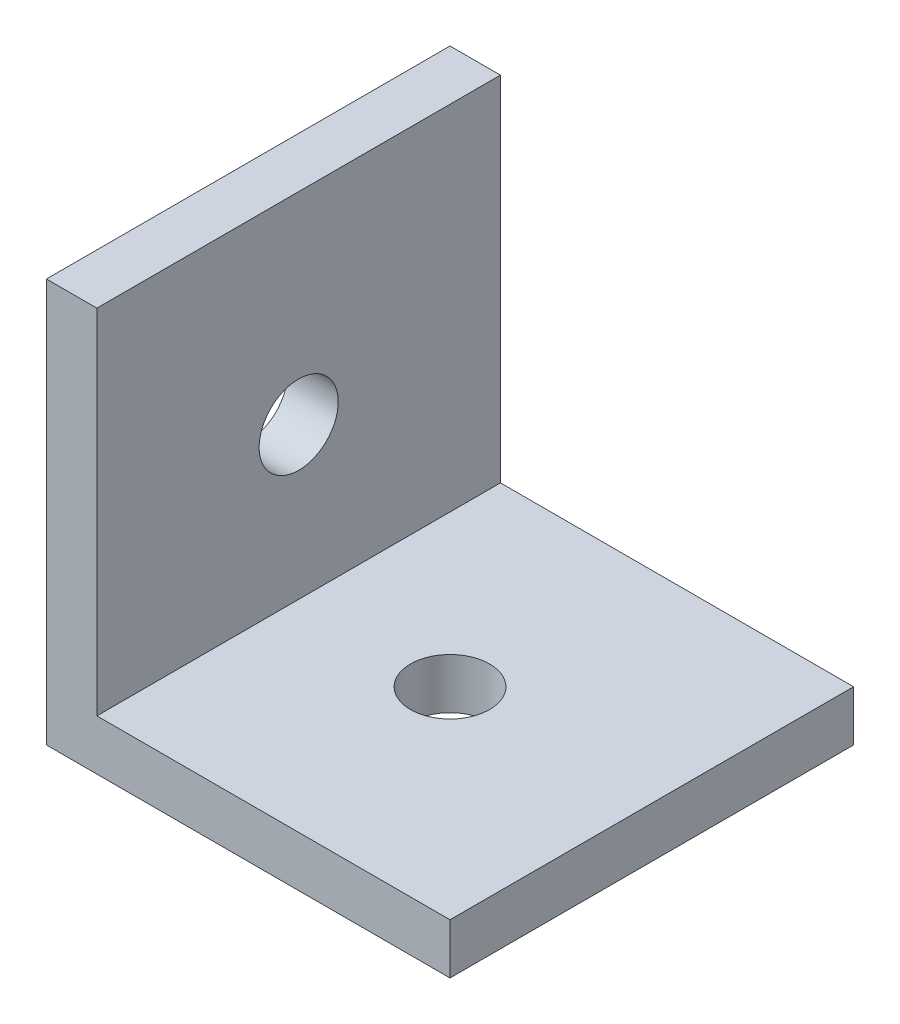
ISO-10303-21;
HEADER;
FILE_DESCRIPTION(('STEP AP214'),'2;1');
FILE_NAME('part.step','',(''),(''),'','','');
FILE_SCHEMA(('AUTOMOTIVE_DESIGN { 1 0 10303 214 1 1 1 1 }'));
ENDSEC;
DATA;
#1=APPLICATION_CONTEXT('core data for automotive mechanical design processes');
#2=APPLICATION_PROTOCOL_DEFINITION('international standard','automotive_design',2000,#1);
#3=PRODUCT_CONTEXT('',#1,'mechanical');
#4=PRODUCT('Part','Part','',(#3));
#5=PRODUCT_RELATED_PRODUCT_CATEGORY('part','',(#4));
#6=PRODUCT_DEFINITION_FORMATION('','',#4);
#7=PRODUCT_DEFINITION_CONTEXT('part definition',#1,'design');
#8=PRODUCT_DEFINITION('design','',#6,#7);
#9=PRODUCT_DEFINITION_SHAPE('','',#8);
#10=(LENGTH_UNIT() NAMED_UNIT(*) SI_UNIT(.MILLI.,.METRE.));
#11=(NAMED_UNIT(*) PLANE_ANGLE_UNIT() SI_UNIT($,.RADIAN.));
#12=(NAMED_UNIT(*) SI_UNIT($,.STERADIAN.) SOLID_ANGLE_UNIT());
#13=UNCERTAINTY_MEASURE_WITH_UNIT(LENGTH_MEASURE(1.E-05),#10,'distance_accuracy_value','');
#14=(GEOMETRIC_REPRESENTATION_CONTEXT(3) GLOBAL_UNCERTAINTY_ASSIGNED_CONTEXT((#13)) GLOBAL_UNIT_ASSIGNED_CONTEXT((#10,
#11,#12)) REPRESENTATION_CONTEXT('',''));
#15=CARTESIAN_POINT('',(0.,0.,0.));
#16=DIRECTION('',(0.,0.,1.));
#17=DIRECTION('',(1.,0.,0.));
#18=AXIS2_PLACEMENT_3D('',#15,#16,#17);
#19=CARTESIAN_POINT('',(0.,0.,-25.4));
#20=DIRECTION('',(0.,-1.,0.));
#21=DIRECTION('',(0.,0.,-1.));
#22=AXIS2_PLACEMENT_3D('',#19,#20,#21);
#23=PLANE('',#22);
#24=CARTESIAN_POINT('',(12.7,0.,-12.7));
#25=DIRECTION('',(0.,-1.,0.));
#26=DIRECTION('',(0.,0.,-1.));
#27=AXIS2_PLACEMENT_3D('',#24,#25,#26);
#28=CIRCLE('',#27,2.4892);
#29=CARTESIAN_POINT('',(12.7,0.,-15.1892));
#30=VERTEX_POINT('',#29);
#31=EDGE_CURVE('E139',#30,#30,#28,.T.);
#32=ORIENTED_EDGE('',*,*,#31,.F.);
#33=EDGE_LOOP('',(#32));
#34=FACE_BOUND('',#33,.T.);
#35=DIRECTION('',(1.,0.,0.));
#36=VECTOR('',#35,1.);
#37=CARTESIAN_POINT('',(0.,0.,0.));
#38=LINE('',#37,#36);
#39=CARTESIAN_POINT('',(0.,0.,0.));
#40=VERTEX_POINT('',#39);
#41=CARTESIAN_POINT('',(25.4,0.,0.));
#42=VERTEX_POINT('',#41);
#43=EDGE_CURVE('E117',#40,#42,#38,.T.);
#44=ORIENTED_EDGE('',*,*,#43,.F.);
#45=DIRECTION('',(0.,0.,1.));
#46=VECTOR('',#45,1.);
#47=CARTESIAN_POINT('',(0.,0.,-25.4));
#48=LINE('',#47,#46);
#49=CARTESIAN_POINT('',(0.,0.,-25.4));
#50=VERTEX_POINT('',#49);
#51=EDGE_CURVE('E11',#50,#40,#48,.T.);
#52=ORIENTED_EDGE('',*,*,#51,.F.);
#53=DIRECTION('',(1.,0.,0.));
#54=VECTOR('',#53,1.);
#55=CARTESIAN_POINT('',(0.,0.,-25.4));
#56=LINE('',#55,#54);
#57=CARTESIAN_POINT('',(25.4,0.,-25.4));
#58=VERTEX_POINT('',#57);
#59=EDGE_CURVE('E131',#50,#58,#56,.T.);
#60=ORIENTED_EDGE('',*,*,#59,.T.);
#61=DIRECTION('',(0.,0.,1.));
#62=VECTOR('',#61,1.);
#63=CARTESIAN_POINT('',(25.4,0.,-25.4));
#64=LINE('',#63,#62);
#65=EDGE_CURVE('E116',#58,#42,#64,.T.);
#66=ORIENTED_EDGE('',*,*,#65,.T.);
#67=EDGE_LOOP('',(#44,#52,#60,#66));
#68=FACE_BOUND('',#67,.T.);
#69=ADVANCED_FACE('F34',(#34,#68),#23,.T.);
#70=CARTESIAN_POINT('',(0.,0.,-25.4));
#71=DIRECTION('',(-1.,0.,0.));
#72=DIRECTION('',(0.,-1.,0.));
#73=AXIS2_PLACEMENT_3D('',#70,#71,#72);
#74=PLANE('',#73);
#75=CARTESIAN_POINT('',(0.,12.7,-12.7));
#76=DIRECTION('',(1.,0.,0.));
#77=DIRECTION('',(0.,0.,-1.));
#78=AXIS2_PLACEMENT_3D('',#75,#76,#77);
#79=CIRCLE('',#78,2.4892);
#80=CARTESIAN_POINT('',(0.,12.7,-15.1892));
#81=VERTEX_POINT('',#80);
#82=EDGE_CURVE('E147',#81,#81,#79,.T.);
#83=ORIENTED_EDGE('',*,*,#82,.T.);
#84=EDGE_LOOP('',(#83));
#85=FACE_BOUND('',#84,.T.);
#86=DIRECTION('',(0.,-1.,0.));
#87=VECTOR('',#86,1.);
#88=CARTESIAN_POINT('',(0.,0.,0.));
#89=LINE('',#88,#87);
#90=CARTESIAN_POINT('',(0.,25.4,0.));
#91=VERTEX_POINT('',#90);
#92=EDGE_CURVE('E129',#91,#40,#89,.T.);
#93=ORIENTED_EDGE('',*,*,#92,.F.);
#94=DIRECTION('',(0.,0.,1.));
#95=VECTOR('',#94,1.);
#96=CARTESIAN_POINT('',(0.,25.4,-25.4));
#97=LINE('',#96,#95);
#98=CARTESIAN_POINT('',(0.,25.4,-25.4));
#99=VERTEX_POINT('',#98);
#100=EDGE_CURVE('E43',#99,#91,#97,.T.);
#101=ORIENTED_EDGE('',*,*,#100,.F.);
#102=DIRECTION('',(0.,-1.,0.));
#103=VECTOR('',#102,1.);
#104=CARTESIAN_POINT('',(0.,0.,-25.4));
#105=LINE('',#104,#103);
#106=EDGE_CURVE('E97',#99,#50,#105,.T.);
#107=ORIENTED_EDGE('',*,*,#106,.T.);
#108=ORIENTED_EDGE('',*,*,#51,.T.);
#109=EDGE_LOOP('',(#93,#101,#107,#108));
#110=FACE_BOUND('',#109,.T.);
#111=ADVANCED_FACE('F150',(#85,#110),#74,.T.);
#112=CARTESIAN_POINT('',(0.,25.4,-25.4));
#113=DIRECTION('',(0.,-1.,0.));
#114=DIRECTION('',(0.,0.,-1.));
#115=AXIS2_PLACEMENT_3D('',#112,#113,#114);
#116=PLANE('',#115);
#117=DIRECTION('',(1.,0.,0.));
#118=VECTOR('',#117,1.);
#119=CARTESIAN_POINT('',(0.,25.4,0.));
#120=LINE('',#119,#118);
#121=CARTESIAN_POINT('',(3.175,25.4,0.));
#122=VERTEX_POINT('',#121);
#123=EDGE_CURVE('E102',#91,#122,#120,.T.);
#124=ORIENTED_EDGE('',*,*,#123,.T.);
#125=DIRECTION('',(0.,0.,1.));
#126=VECTOR('',#125,1.);
#127=CARTESIAN_POINT('',(3.175,25.4,-25.4));
#128=LINE('',#127,#126);
#129=CARTESIAN_POINT('',(3.175,25.4,-25.4));
#130=VERTEX_POINT('',#129);
#131=EDGE_CURVE('E100',#130,#122,#128,.T.);
#132=ORIENTED_EDGE('',*,*,#131,.F.);
#133=DIRECTION('',(1.,0.,0.));
#134=VECTOR('',#133,1.);
#135=CARTESIAN_POINT('',(0.,25.4,-25.4));
#136=LINE('',#135,#134);
#137=EDGE_CURVE('E91',#99,#130,#136,.T.);
#138=ORIENTED_EDGE('',*,*,#137,.F.);
#139=ORIENTED_EDGE('',*,*,#100,.T.);
#140=EDGE_LOOP('',(#124,#132,#138,#139));
#141=FACE_BOUND('',#140,.T.);
#142=ADVANCED_FACE('F101',(#141),#116,.F.);
#143=CARTESIAN_POINT('',(3.175,0.,-25.4));
#144=DIRECTION('',(-1.,0.,0.));
#145=DIRECTION('',(0.,-1.,0.));
#146=AXIS2_PLACEMENT_3D('',#143,#144,#145);
#147=PLANE('',#146);
#148=CARTESIAN_POINT('',(3.175,12.7,-12.7));
#149=DIRECTION('',(-1.,0.,0.));
#150=DIRECTION('',(0.,-1.,0.));
#151=AXIS2_PLACEMENT_3D('',#148,#149,#150);
#152=CIRCLE('',#151,2.4892);
#153=CARTESIAN_POINT('',(3.175,10.2108,-12.7));
#154=VERTEX_POINT('',#153);
#155=EDGE_CURVE('E37',#154,#154,#152,.F.);
#156=ORIENTED_EDGE('',*,*,#155,.F.);
#157=EDGE_LOOP('',(#156));
#158=FACE_BOUND('',#157,.T.);
#159=DIRECTION('',(0.,-1.,0.));
#160=VECTOR('',#159,1.);
#161=CARTESIAN_POINT('',(3.175,0.,0.));
#162=LINE('',#161,#160);
#163=CARTESIAN_POINT('',(3.175,3.175,0.));
#164=VERTEX_POINT('',#163);
#165=EDGE_CURVE('E126',#122,#164,#162,.T.);
#166=ORIENTED_EDGE('',*,*,#165,.T.);
#167=DIRECTION('',(0.,0.,1.));
#168=VECTOR('',#167,1.);
#169=CARTESIAN_POINT('',(3.175,3.175,-25.4));
#170=LINE('',#169,#168);
#171=CARTESIAN_POINT('',(3.175,3.175,-25.4));
#172=VERTEX_POINT('',#171);
#173=EDGE_CURVE('E105',#172,#164,#170,.T.);
#174=ORIENTED_EDGE('',*,*,#173,.F.);
#175=DIRECTION('',(0.,-1.,0.));
#176=VECTOR('',#175,1.);
#177=CARTESIAN_POINT('',(3.175,0.,-25.4));
#178=LINE('',#177,#176);
#179=EDGE_CURVE('E95',#130,#172,#178,.T.);
#180=ORIENTED_EDGE('',*,*,#179,.F.);
#181=ORIENTED_EDGE('',*,*,#131,.T.);
#182=EDGE_LOOP('',(#166,#174,#180,#181));
#183=FACE_BOUND('',#182,.T.);
#184=ADVANCED_FACE('F107',(#158,#183),#147,.F.);
#185=CARTESIAN_POINT('',(0.,3.175,-25.4));
#186=DIRECTION('',(0.,-1.,0.));
#187=DIRECTION('',(0.,0.,-1.));
#188=AXIS2_PLACEMENT_3D('',#185,#186,#187);
#189=PLANE('',#188);
#190=CARTESIAN_POINT('',(12.7,3.175,-12.7));
#191=DIRECTION('',(0.,-1.,0.));
#192=DIRECTION('',(0.,0.,-1.));
#193=AXIS2_PLACEMENT_3D('',#190,#191,#192);
#194=CIRCLE('',#193,2.4892);
#195=CARTESIAN_POINT('',(12.7,3.175,-15.1892));
#196=VERTEX_POINT('',#195);
#197=EDGE_CURVE('E121',#196,#196,#194,.T.);
#198=ORIENTED_EDGE('',*,*,#197,.T.);
#199=EDGE_LOOP('',(#198));
#200=FACE_BOUND('',#199,.T.);
#201=DIRECTION('',(1.,0.,0.));
#202=VECTOR('',#201,1.);
#203=CARTESIAN_POINT('',(0.,3.175,0.));
#204=LINE('',#203,#202);
#205=CARTESIAN_POINT('',(25.4,3.175,0.));
#206=VERTEX_POINT('',#205);
#207=EDGE_CURVE('E124',#164,#206,#204,.T.);
#208=ORIENTED_EDGE('',*,*,#207,.T.);
#209=DIRECTION('',(0.,0.,1.));
#210=VECTOR('',#209,1.);
#211=CARTESIAN_POINT('',(25.4,3.175,-25.4));
#212=LINE('',#211,#210);
#213=CARTESIAN_POINT('',(25.4,3.175,-25.4));
#214=VERTEX_POINT('',#213);
#215=EDGE_CURVE('E135',#214,#206,#212,.T.);
#216=ORIENTED_EDGE('',*,*,#215,.F.);
#217=DIRECTION('',(1.,0.,0.));
#218=VECTOR('',#217,1.);
#219=CARTESIAN_POINT('',(0.,3.175,-25.4));
#220=LINE('',#219,#218);
#221=EDGE_CURVE('E110',#172,#214,#220,.T.);
#222=ORIENTED_EDGE('',*,*,#221,.F.);
#223=ORIENTED_EDGE('',*,*,#173,.T.);
#224=EDGE_LOOP('',(#208,#216,#222,#223));
#225=FACE_BOUND('',#224,.T.);
#226=ADVANCED_FACE('F156',(#200,#225),#189,.F.);
#227=CARTESIAN_POINT('',(25.4,3.175,-25.4));
#228=DIRECTION('',(-1.,0.,0.));
#229=DIRECTION('',(0.,0.,1.));
#230=AXIS2_PLACEMENT_3D('',#227,#228,#229);
#231=PLANE('',#230);
#232=DIRECTION('',(0.,-1.,0.));
#233=VECTOR('',#232,1.);
#234=CARTESIAN_POINT('',(25.4,3.175,0.));
#235=LINE('',#234,#233);
#236=EDGE_CURVE('E120',#206,#42,#235,.T.);
#237=ORIENTED_EDGE('',*,*,#236,.T.);
#238=ORIENTED_EDGE('',*,*,#65,.F.);
#239=DIRECTION('',(0.,-1.,0.));
#240=VECTOR('',#239,1.);
#241=CARTESIAN_POINT('',(25.4,3.175,-25.4));
#242=LINE('',#241,#240);
#243=EDGE_CURVE('E83',#214,#58,#242,.T.);
#244=ORIENTED_EDGE('',*,*,#243,.F.);
#245=ORIENTED_EDGE('',*,*,#215,.T.);
#246=EDGE_LOOP('',(#237,#238,#244,#245));
#247=FACE_BOUND('',#246,.T.);
#248=ADVANCED_FACE('F159',(#247),#231,.F.);
#249=CARTESIAN_POINT('',(0.,0.,-25.4));
#250=DIRECTION('',(0.,0.,-1.));
#251=DIRECTION('',(-1.,0.,0.));
#252=AXIS2_PLACEMENT_3D('',#249,#250,#251);
#253=PLANE('',#252);
#254=ORIENTED_EDGE('',*,*,#59,.F.);
#255=ORIENTED_EDGE('',*,*,#106,.F.);
#256=ORIENTED_EDGE('',*,*,#137,.T.);
#257=ORIENTED_EDGE('',*,*,#179,.T.);
#258=ORIENTED_EDGE('',*,*,#221,.T.);
#259=ORIENTED_EDGE('',*,*,#243,.T.);
#260=EDGE_LOOP('',(#254,#255,#256,#257,#258,#259));
#261=FACE_BOUND('',#260,.T.);
#262=ADVANCED_FACE('F93',(#261),#253,.T.);
#263=CARTESIAN_POINT('',(0.,0.,0.));
#264=DIRECTION('',(0.,0.,-1.));
#265=DIRECTION('',(-1.,0.,0.));
#266=AXIS2_PLACEMENT_3D('',#263,#264,#265);
#267=PLANE('',#266);
#268=ORIENTED_EDGE('',*,*,#43,.T.);
#269=ORIENTED_EDGE('',*,*,#236,.F.);
#270=ORIENTED_EDGE('',*,*,#207,.F.);
#271=ORIENTED_EDGE('',*,*,#165,.F.);
#272=ORIENTED_EDGE('',*,*,#123,.F.);
#273=ORIENTED_EDGE('',*,*,#92,.T.);
#274=EDGE_LOOP('',(#268,#269,#270,#271,#272,#273));
#275=FACE_BOUND('',#274,.T.);
#276=ADVANCED_FACE('F152',(#275),#267,.F.);
#277=CARTESIAN_POINT('',(12.7,25.4,-12.7));
#278=DIRECTION('',(0.,-1.,0.));
#279=DIRECTION('',(0.,0.,-1.));
#280=AXIS2_PLACEMENT_3D('',#277,#278,#279);
#281=CYLINDRICAL_SURFACE('',#280,2.4892);
#282=ORIENTED_EDGE('',*,*,#31,.T.);
#283=EDGE_LOOP('',(#282));
#284=FACE_BOUND('',#283,.T.);
#285=ORIENTED_EDGE('',*,*,#197,.F.);
#286=EDGE_LOOP('',(#285));
#287=FACE_BOUND('',#286,.T.);
#288=ADVANCED_FACE('F189',(#284,#287),#281,.F.);
#289=CARTESIAN_POINT('',(25.4,12.7,-12.7));
#290=DIRECTION('',(-1.,0.,0.));
#291=DIRECTION('',(0.,-1.,0.));
#292=AXIS2_PLACEMENT_3D('',#289,#290,#291);
#293=CYLINDRICAL_SURFACE('',#292,2.4892);
#294=ORIENTED_EDGE('',*,*,#82,.F.);
#295=EDGE_LOOP('',(#294));
#296=FACE_BOUND('',#295,.T.);
#297=ORIENTED_EDGE('',*,*,#155,.T.);
#298=EDGE_LOOP('',(#297));
#299=FACE_BOUND('',#298,.T.);
#300=ADVANCED_FACE('F187',(#296,#299),#293,.F.);
#301=CLOSED_SHELL('',(#69,#111,#142,#184,#226,#248,#262,#276,#288,#300));
#302=MANIFOLD_SOLID_BREP('B2',#301);
#303=ADVANCED_BREP_SHAPE_REPRESENTATION('',(#18,#302),#14);
#304=SHAPE_DEFINITION_REPRESENTATION(#9,#303);
ENDSEC;
END-ISO-10303-21;
